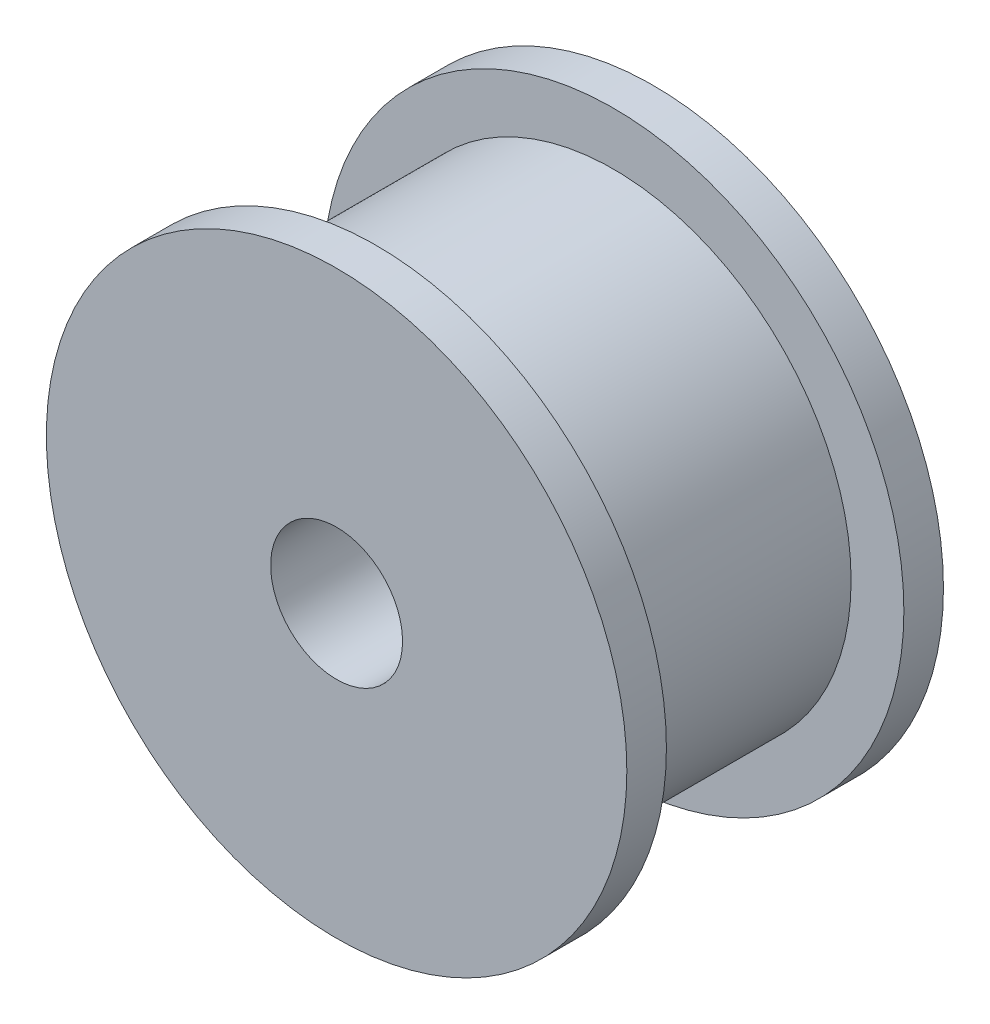
ISO-10303-21;
HEADER;
FILE_DESCRIPTION(('STEP AP214'),'2;1');
FILE_NAME('part.step','',(''),(''),'','','');
FILE_SCHEMA(('AUTOMOTIVE_DESIGN { 1 0 10303 214 1 1 1 1 }'));
ENDSEC;
DATA;
#1=APPLICATION_CONTEXT('core data for automotive mechanical design processes');
#2=APPLICATION_PROTOCOL_DEFINITION('international standard','automotive_design',2000,#1);
#3=PRODUCT_CONTEXT('',#1,'mechanical');
#4=PRODUCT('Part','Part','',(#3));
#5=PRODUCT_RELATED_PRODUCT_CATEGORY('part','',(#4));
#6=PRODUCT_DEFINITION_FORMATION('','',#4);
#7=PRODUCT_DEFINITION_CONTEXT('part definition',#1,'design');
#8=PRODUCT_DEFINITION('design','',#6,#7);
#9=PRODUCT_DEFINITION_SHAPE('','',#8);
#10=(LENGTH_UNIT() NAMED_UNIT(*) SI_UNIT(.MILLI.,.METRE.));
#11=(NAMED_UNIT(*) PLANE_ANGLE_UNIT() SI_UNIT($,.RADIAN.));
#12=(NAMED_UNIT(*) SI_UNIT($,.STERADIAN.) SOLID_ANGLE_UNIT());
#13=UNCERTAINTY_MEASURE_WITH_UNIT(LENGTH_MEASURE(1.E-05),#10,'distance_accuracy_value','');
#14=(GEOMETRIC_REPRESENTATION_CONTEXT(3) GLOBAL_UNCERTAINTY_ASSIGNED_CONTEXT((#13)) GLOBAL_UNIT_ASSIGNED_CONTEXT((#10,
#11,#12)) REPRESENTATION_CONTEXT('',''));
#15=CARTESIAN_POINT('',(0.,0.,0.));
#16=DIRECTION('',(0.,0.,1.));
#17=DIRECTION('',(1.,0.,0.));
#18=AXIS2_PLACEMENT_3D('',#15,#16,#17);
#19=CARTESIAN_POINT('',(0.,0.,1.5));
#20=DIRECTION('',(0.,0.,-1.));
#21=DIRECTION('',(-1.,0.,0.));
#22=AXIS2_PLACEMENT_3D('',#19,#20,#21);
#23=CYLINDRICAL_SURFACE('',#22,11.);
#24=CARTESIAN_POINT('',(0.,0.,1.5));
#25=DIRECTION('',(0.,0.,1.));
#26=DIRECTION('',(1.,0.,0.));
#27=AXIS2_PLACEMENT_3D('',#24,#25,#26);
#28=CIRCLE('',#27,11.);
#29=CARTESIAN_POINT('',(11.,0.,1.5));
#30=VERTEX_POINT('',#29);
#31=EDGE_CURVE('E44',#30,#30,#28,.T.);
#32=ORIENTED_EDGE('',*,*,#31,.F.);
#33=EDGE_LOOP('',(#32));
#34=FACE_BOUND('',#33,.T.);
#35=CARTESIAN_POINT('',(0.,0.,0.));
#36=DIRECTION('',(0.,0.,1.));
#37=DIRECTION('',(1.,0.,0.));
#38=AXIS2_PLACEMENT_3D('',#35,#36,#37);
#39=CIRCLE('',#38,11.);
#40=CARTESIAN_POINT('',(11.,0.,0.));
#41=VERTEX_POINT('',#40);
#42=EDGE_CURVE('E49',#41,#41,#39,.T.);
#43=ORIENTED_EDGE('',*,*,#42,.T.);
#44=EDGE_LOOP('',(#43));
#45=FACE_BOUND('',#44,.T.);
#46=ADVANCED_FACE('F37',(#34,#45),#23,.T.);
#47=CARTESIAN_POINT('',(0.,0.,1.5));
#48=DIRECTION('',(0.,0.,1.));
#49=DIRECTION('',(1.,0.,0.));
#50=AXIS2_PLACEMENT_3D('',#47,#48,#49);
#51=PLANE('',#50);
#52=CARTESIAN_POINT('',(0.,0.,1.5));
#53=DIRECTION('',(0.,0.,1.));
#54=DIRECTION('',(1.,0.,0.));
#55=AXIS2_PLACEMENT_3D('',#52,#53,#54);
#56=CIRCLE('',#55,9.);
#57=CARTESIAN_POINT('',(9.,0.,1.5));
#58=VERTEX_POINT('',#57);
#59=EDGE_CURVE('E10',#58,#58,#56,.T.);
#60=ORIENTED_EDGE('',*,*,#59,.F.);
#61=EDGE_LOOP('',(#60));
#62=FACE_BOUND('',#61,.T.);
#63=ORIENTED_EDGE('',*,*,#31,.T.);
#64=EDGE_LOOP('',(#63));
#65=FACE_BOUND('',#64,.T.);
#66=ADVANCED_FACE('F95',(#62,#65),#51,.T.);
#67=CARTESIAN_POINT('',(0.,0.,0.));
#68=DIRECTION('',(0.,0.,1.));
#69=DIRECTION('',(1.,0.,0.));
#70=AXIS2_PLACEMENT_3D('',#67,#68,#69);
#71=PLANE('',#70);
#72=CARTESIAN_POINT('',(0.,0.,0.));
#73=DIRECTION('',(0.,0.,1.));
#74=DIRECTION('',(1.,0.,0.));
#75=AXIS2_PLACEMENT_3D('',#72,#73,#74);
#76=CIRCLE('',#75,2.5);
#77=CARTESIAN_POINT('',(2.5,0.,0.));
#78=VERTEX_POINT('',#77);
#79=EDGE_CURVE('E68',#78,#78,#76,.T.);
#80=ORIENTED_EDGE('',*,*,#79,.T.);
#81=EDGE_LOOP('',(#80));
#82=FACE_BOUND('',#81,.T.);
#83=ORIENTED_EDGE('',*,*,#42,.F.);
#84=EDGE_LOOP('',(#83));
#85=FACE_BOUND('',#84,.T.);
#86=ADVANCED_FACE('F100',(#82,#85),#71,.F.);
#87=CARTESIAN_POINT('',(0.,0.,10.5));
#88=DIRECTION('',(0.,0.,-1.));
#89=DIRECTION('',(-1.,0.,0.));
#90=AXIS2_PLACEMENT_3D('',#87,#88,#89);
#91=CYLINDRICAL_SURFACE('',#90,9.);
#92=CARTESIAN_POINT('',(0.,0.,10.5));
#93=DIRECTION('',(0.,0.,1.));
#94=DIRECTION('',(1.,0.,0.));
#95=AXIS2_PLACEMENT_3D('',#92,#93,#94);
#96=CIRCLE('',#95,9.);
#97=CARTESIAN_POINT('',(9.,0.,10.5));
#98=VERTEX_POINT('',#97);
#99=EDGE_CURVE('E52',#98,#98,#96,.T.);
#100=ORIENTED_EDGE('',*,*,#99,.F.);
#101=EDGE_LOOP('',(#100));
#102=FACE_BOUND('',#101,.T.);
#103=ORIENTED_EDGE('',*,*,#59,.T.);
#104=EDGE_LOOP('',(#103));
#105=FACE_BOUND('',#104,.T.);
#106=ADVANCED_FACE('F90',(#102,#105),#91,.T.);
#107=CARTESIAN_POINT('',(0.,0.,12.));
#108=DIRECTION('',(0.,0.,-1.));
#109=DIRECTION('',(-1.,0.,0.));
#110=AXIS2_PLACEMENT_3D('',#107,#108,#109);
#111=CYLINDRICAL_SURFACE('',#110,11.);
#112=CARTESIAN_POINT('',(0.,0.,12.));
#113=DIRECTION('',(0.,0.,1.));
#114=DIRECTION('',(1.,0.,0.));
#115=AXIS2_PLACEMENT_3D('',#112,#113,#114);
#116=CIRCLE('',#115,11.);
#117=CARTESIAN_POINT('',(11.,0.,12.));
#118=VERTEX_POINT('',#117);
#119=EDGE_CURVE('E58',#118,#118,#116,.T.);
#120=ORIENTED_EDGE('',*,*,#119,.F.);
#121=EDGE_LOOP('',(#120));
#122=FACE_BOUND('',#121,.T.);
#123=CARTESIAN_POINT('',(0.,0.,10.5));
#124=DIRECTION('',(0.,0.,1.));
#125=DIRECTION('',(1.,0.,0.));
#126=AXIS2_PLACEMENT_3D('',#123,#124,#125);
#127=CIRCLE('',#126,11.);
#128=CARTESIAN_POINT('',(11.,0.,10.5));
#129=VERTEX_POINT('',#128);
#130=EDGE_CURVE('E62',#129,#129,#127,.T.);
#131=ORIENTED_EDGE('',*,*,#130,.T.);
#132=EDGE_LOOP('',(#131));
#133=FACE_BOUND('',#132,.T.);
#134=ADVANCED_FACE('F81',(#122,#133),#111,.T.);
#135=CARTESIAN_POINT('',(0.,0.,12.));
#136=DIRECTION('',(0.,0.,1.));
#137=DIRECTION('',(1.,0.,0.));
#138=AXIS2_PLACEMENT_3D('',#135,#136,#137);
#139=PLANE('',#138);
#140=CARTESIAN_POINT('',(0.,0.,12.));
#141=DIRECTION('',(0.,0.,1.));
#142=DIRECTION('',(1.,0.,0.));
#143=AXIS2_PLACEMENT_3D('',#140,#141,#142);
#144=CIRCLE('',#143,2.5);
#145=CARTESIAN_POINT('',(2.5,0.,12.));
#146=VERTEX_POINT('',#145);
#147=EDGE_CURVE('E40',#146,#146,#144,.T.);
#148=ORIENTED_EDGE('',*,*,#147,.F.);
#149=EDGE_LOOP('',(#148));
#150=FACE_BOUND('',#149,.T.);
#151=ORIENTED_EDGE('',*,*,#119,.T.);
#152=EDGE_LOOP('',(#151));
#153=FACE_BOUND('',#152,.T.);
#154=ADVANCED_FACE('F78',(#150,#153),#139,.T.);
#155=CARTESIAN_POINT('',(0.,0.,10.5));
#156=DIRECTION('',(0.,0.,1.));
#157=DIRECTION('',(1.,0.,0.));
#158=AXIS2_PLACEMENT_3D('',#155,#156,#157);
#159=PLANE('',#158);
#160=ORIENTED_EDGE('',*,*,#99,.T.);
#161=EDGE_LOOP('',(#160));
#162=FACE_BOUND('',#161,.T.);
#163=ORIENTED_EDGE('',*,*,#130,.F.);
#164=EDGE_LOOP('',(#163));
#165=FACE_BOUND('',#164,.T.);
#166=ADVANCED_FACE('F80',(#162,#165),#159,.F.);
#167=CARTESIAN_POINT('',(0.,0.,0.));
#168=DIRECTION('',(0.,0.,1.));
#169=DIRECTION('',(1.,0.,0.));
#170=AXIS2_PLACEMENT_3D('',#167,#168,#169);
#171=CYLINDRICAL_SURFACE('',#170,2.5);
#172=ORIENTED_EDGE('',*,*,#147,.T.);
#173=EDGE_LOOP('',(#172));
#174=FACE_BOUND('',#173,.T.);
#175=ORIENTED_EDGE('',*,*,#79,.F.);
#176=EDGE_LOOP('',(#175));
#177=FACE_BOUND('',#176,.T.);
#178=ADVANCED_FACE('F75',(#174,#177),#171,.F.);
#179=CLOSED_SHELL('',(#46,#66,#86,#106,#134,#154,#166,#178));
#180=MANIFOLD_SOLID_BREP('B2',#179);
#181=ADVANCED_BREP_SHAPE_REPRESENTATION('',(#18,#180),#14);
#182=SHAPE_DEFINITION_REPRESENTATION(#9,#181);
ENDSEC;
END-ISO-10303-21;
